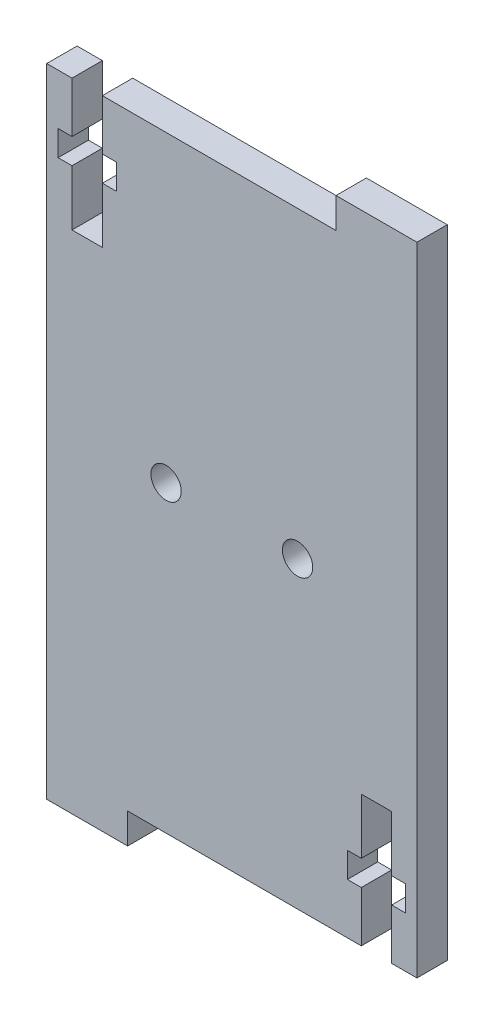
ISO-10303-21;
HEADER;
FILE_DESCRIPTION(('STEP AP214'),'2;1');
FILE_NAME('part.step','',(''),(''),'','','');
FILE_SCHEMA(('AUTOMOTIVE_DESIGN { 1 0 10303 214 1 1 1 1 }'));
ENDSEC;
DATA;
#1=APPLICATION_CONTEXT('core data for automotive mechanical design processes');
#2=APPLICATION_PROTOCOL_DEFINITION('international standard','automotive_design',2000,#1);
#3=PRODUCT_CONTEXT('',#1,'mechanical');
#4=PRODUCT('Part','Part','',(#3));
#5=PRODUCT_RELATED_PRODUCT_CATEGORY('part','',(#4));
#6=PRODUCT_DEFINITION_FORMATION('','',#4);
#7=PRODUCT_DEFINITION_CONTEXT('part definition',#1,'design');
#8=PRODUCT_DEFINITION('design','',#6,#7);
#9=PRODUCT_DEFINITION_SHAPE('','',#8);
#10=(LENGTH_UNIT() NAMED_UNIT(*) SI_UNIT(.MILLI.,.METRE.));
#11=(NAMED_UNIT(*) PLANE_ANGLE_UNIT() SI_UNIT($,.RADIAN.));
#12=(NAMED_UNIT(*) SI_UNIT($,.STERADIAN.) SOLID_ANGLE_UNIT());
#13=UNCERTAINTY_MEASURE_WITH_UNIT(LENGTH_MEASURE(1.E-05),#10,'distance_accuracy_value','');
#14=(GEOMETRIC_REPRESENTATION_CONTEXT(3) GLOBAL_UNCERTAINTY_ASSIGNED_CONTEXT((#13)) GLOBAL_UNIT_ASSIGNED_CONTEXT((#10,
#11,#12)) REPRESENTATION_CONTEXT('',''));
#15=CARTESIAN_POINT('',(0.,0.,0.));
#16=DIRECTION('',(0.,0.,1.));
#17=DIRECTION('',(1.,0.,0.));
#18=AXIS2_PLACEMENT_3D('',#15,#16,#17);
#19=CARTESIAN_POINT('',(0.,0.,3.));
#20=DIRECTION('',(0.,0.,-1.));
#21=DIRECTION('',(-1.,0.,0.));
#22=AXIS2_PLACEMENT_3D('',#19,#20,#21);
#23=PLANE('',#22);
#24=DIRECTION('',(1.,0.,0.));
#25=VECTOR('',#24,1.);
#26=CARTESIAN_POINT('',(24.8,-30.,3.));
#27=LINE('',#26,#25);
#28=CARTESIAN_POINT('',(22.3000000000002,-30.,3.));
#29=VERTEX_POINT('',#28);
#30=CARTESIAN_POINT('',(24.8,-30.,3.));
#31=VERTEX_POINT('',#30);
#32=EDGE_CURVE('E381',#29,#31,#27,.T.);
#33=ORIENTED_EDGE('',*,*,#32,.T.);
#34=DIRECTION('',(0.,1.,0.));
#35=VECTOR('',#34,1.);
#36=CARTESIAN_POINT('',(24.8,33.,3.));
#37=LINE('',#36,#35);
#38=CARTESIAN_POINT('',(24.8,33.,3.));
#39=VERTEX_POINT('',#38);
#40=EDGE_CURVE('E172',#31,#39,#37,.T.);
#41=ORIENTED_EDGE('',*,*,#40,.T.);
#42=DIRECTION('',(-1.,0.,0.));
#43=VECTOR('',#42,1.);
#44=CARTESIAN_POINT('',(24.8,33.,3.));
#45=LINE('',#44,#43);
#46=CARTESIAN_POINT('',(16.8,33.,3.));
#47=VERTEX_POINT('',#46);
#48=EDGE_CURVE('E498',#39,#47,#45,.T.);
#49=ORIENTED_EDGE('',*,*,#48,.T.);
#50=DIRECTION('',(0.,-1.,0.));
#51=VECTOR('',#50,1.);
#52=CARTESIAN_POINT('',(16.8,30.,3.));
#53=LINE('',#52,#51);
#54=CARTESIAN_POINT('',(16.8,30.,3.));
#55=VERTEX_POINT('',#54);
#56=EDGE_CURVE('E518',#47,#55,#53,.T.);
#57=ORIENTED_EDGE('',*,*,#56,.T.);
#58=DIRECTION('',(-1.,0.,0.));
#59=VECTOR('',#58,1.);
#60=CARTESIAN_POINT('',(16.8,30.,3.));
#61=LINE('',#60,#59);
#62=CARTESIAN_POINT('',(-6.29999999999978,30.,3.));
#63=VERTEX_POINT('',#62);
#64=EDGE_CURVE('E514',#55,#63,#61,.T.);
#65=ORIENTED_EDGE('',*,*,#64,.T.);
#66=DIRECTION('',(0.,-1.,0.));
#67=VECTOR('',#66,1.);
#68=CARTESIAN_POINT('',(-6.29999999999978,25.0000000000004,3.));
#69=LINE('',#68,#67);
#70=CARTESIAN_POINT('',(-6.29999999999978,25.0000000000004,3.));
#71=VERTEX_POINT('',#70);
#72=EDGE_CURVE('E517',#63,#71,#69,.T.);
#73=ORIENTED_EDGE('',*,*,#72,.T.);
#74=DIRECTION('',(1.,0.,0.));
#75=VECTOR('',#74,1.);
#76=CARTESIAN_POINT('',(-4.9249999999999,25.0000000000004,3.));
#77=LINE('',#76,#75);
#78=CARTESIAN_POINT('',(-4.9249999999999,25.0000000000004,3.));
#79=VERTEX_POINT('',#78);
#80=EDGE_CURVE('E522',#71,#79,#77,.T.);
#81=ORIENTED_EDGE('',*,*,#80,.T.);
#82=DIRECTION('',(0.,-1.,0.));
#83=VECTOR('',#82,1.);
#84=CARTESIAN_POINT('',(-4.9249999999999,22.5,3.));
#85=LINE('',#84,#83);
#86=CARTESIAN_POINT('',(-4.9249999999999,22.5,3.));
#87=VERTEX_POINT('',#86);
#88=EDGE_CURVE('E529',#79,#87,#85,.T.);
#89=ORIENTED_EDGE('',*,*,#88,.T.);
#90=DIRECTION('',(-1.,0.,0.));
#91=VECTOR('',#90,1.);
#92=CARTESIAN_POINT('',(-6.29999999999978,22.5,3.));
#93=LINE('',#92,#91);
#94=CARTESIAN_POINT('',(-6.29999999999978,22.5,3.));
#95=VERTEX_POINT('',#94);
#96=EDGE_CURVE('E532',#87,#95,#93,.T.);
#97=ORIENTED_EDGE('',*,*,#96,.T.);
#98=DIRECTION('',(0.,-1.,0.));
#99=VECTOR('',#98,1.);
#100=CARTESIAN_POINT('',(-6.29999999999978,17.,3.));
#101=LINE('',#100,#99);
#102=CARTESIAN_POINT('',(-6.29999999999978,17.,3.));
#103=VERTEX_POINT('',#102);
#104=EDGE_CURVE('E535',#95,#103,#101,.T.);
#105=ORIENTED_EDGE('',*,*,#104,.T.);
#106=DIRECTION('',(-1.,0.,0.));
#107=VECTOR('',#106,1.);
#108=CARTESIAN_POINT('',(-9.3000000000002,17.,3.));
#109=LINE('',#108,#107);
#110=CARTESIAN_POINT('',(-9.3000000000002,17.,3.));
#111=VERTEX_POINT('',#110);
#112=EDGE_CURVE('E538',#103,#111,#109,.T.);
#113=ORIENTED_EDGE('',*,*,#112,.T.);
#114=DIRECTION('',(0.,1.,0.));
#115=VECTOR('',#114,1.);
#116=CARTESIAN_POINT('',(-9.3000000000002,22.5,3.));
#117=LINE('',#116,#115);
#118=CARTESIAN_POINT('',(-9.3000000000002,22.5,3.));
#119=VERTEX_POINT('',#118);
#120=EDGE_CURVE('E541',#111,#119,#117,.T.);
#121=ORIENTED_EDGE('',*,*,#120,.T.);
#122=DIRECTION('',(-1.,0.,0.));
#123=VECTOR('',#122,1.);
#124=CARTESIAN_POINT('',(-10.6750000000008,22.5,3.));
#125=LINE('',#124,#123);
#126=CARTESIAN_POINT('',(-10.6750000000008,22.5,3.));
#127=VERTEX_POINT('',#126);
#128=EDGE_CURVE('E544',#119,#127,#125,.T.);
#129=ORIENTED_EDGE('',*,*,#128,.T.);
#130=DIRECTION('',(0.,1.,0.));
#131=VECTOR('',#130,1.);
#132=CARTESIAN_POINT('',(-10.6750000000008,25.0000000000004,3.));
#133=LINE('',#132,#131);
#134=CARTESIAN_POINT('',(-10.6750000000008,25.0000000000004,3.));
#135=VERTEX_POINT('',#134);
#136=EDGE_CURVE('E547',#127,#135,#133,.T.);
#137=ORIENTED_EDGE('',*,*,#136,.T.);
#138=DIRECTION('',(1.,0.,0.));
#139=VECTOR('',#138,1.);
#140=CARTESIAN_POINT('',(-9.3000000000002,25.0000000000004,3.));
#141=LINE('',#140,#139);
#142=CARTESIAN_POINT('',(-9.3000000000002,25.0000000000004,3.));
#143=VERTEX_POINT('',#142);
#144=EDGE_CURVE('E550',#135,#143,#141,.T.);
#145=ORIENTED_EDGE('',*,*,#144,.T.);
#146=DIRECTION('',(0.,1.,0.));
#147=VECTOR('',#146,1.);
#148=CARTESIAN_POINT('',(-9.3000000000002,30.,3.));
#149=LINE('',#148,#147);
#150=CARTESIAN_POINT('',(-9.3000000000002,30.,3.));
#151=VERTEX_POINT('',#150);
#152=EDGE_CURVE('E553',#143,#151,#149,.T.);
#153=ORIENTED_EDGE('',*,*,#152,.T.);
#154=DIRECTION('',(-1.,0.,0.));
#155=VECTOR('',#154,1.);
#156=CARTESIAN_POINT('',(-9.3000000000002,30.,3.));
#157=LINE('',#156,#155);
#158=CARTESIAN_POINT('',(-11.8,30.,3.));
#159=VERTEX_POINT('',#158);
#160=EDGE_CURVE('E556',#151,#159,#157,.T.);
#161=ORIENTED_EDGE('',*,*,#160,.T.);
#162=DIRECTION('',(0.,-1.,0.));
#163=VECTOR('',#162,1.);
#164=CARTESIAN_POINT('',(-11.8,30.,3.));
#165=LINE('',#164,#163);
#166=CARTESIAN_POINT('',(-11.8,-33.0000000000007,3.));
#167=VERTEX_POINT('',#166);
#168=EDGE_CURVE('E559',#159,#167,#165,.T.);
#169=ORIENTED_EDGE('',*,*,#168,.T.);
#170=DIRECTION('',(1.,0.,0.));
#171=VECTOR('',#170,1.);
#172=CARTESIAN_POINT('',(-3.8,-33.0000000000007,3.));
#173=LINE('',#172,#171);
#174=CARTESIAN_POINT('',(-3.8,-33.0000000000007,3.));
#175=VERTEX_POINT('',#174);
#176=EDGE_CURVE('E562',#167,#175,#173,.T.);
#177=ORIENTED_EDGE('',*,*,#176,.T.);
#178=DIRECTION('',(0.,1.,0.));
#179=VECTOR('',#178,1.);
#180=CARTESIAN_POINT('',(-3.8,-33.0000000000007,3.));
#181=LINE('',#180,#179);
#182=CARTESIAN_POINT('',(-3.8,-30.,3.));
#183=VERTEX_POINT('',#182);
#184=EDGE_CURVE('E565',#175,#183,#181,.T.);
#185=ORIENTED_EDGE('',*,*,#184,.T.);
#186=DIRECTION('',(1.,0.,0.));
#187=VECTOR('',#186,1.);
#188=CARTESIAN_POINT('',(19.2999999999998,-30.,3.));
#189=LINE('',#188,#187);
#190=CARTESIAN_POINT('',(19.2999999999998,-30.,3.));
#191=VERTEX_POINT('',#190);
#192=EDGE_CURVE('E568',#183,#191,#189,.T.);
#193=ORIENTED_EDGE('',*,*,#192,.T.);
#194=DIRECTION('',(0.,1.,0.));
#195=VECTOR('',#194,1.);
#196=CARTESIAN_POINT('',(19.2999999999998,-25.0000000000004,3.));
#197=LINE('',#196,#195);
#198=CARTESIAN_POINT('',(19.2999999999998,-25.0000000000004,3.));
#199=VERTEX_POINT('',#198);
#200=EDGE_CURVE('E571',#191,#199,#197,.T.);
#201=ORIENTED_EDGE('',*,*,#200,.T.);
#202=DIRECTION('',(-1.,0.,0.));
#203=VECTOR('',#202,1.);
#204=CARTESIAN_POINT('',(17.9249999999999,-25.0000000000004,3.));
#205=LINE('',#204,#203);
#206=CARTESIAN_POINT('',(17.9249999999999,-25.0000000000004,3.));
#207=VERTEX_POINT('',#206);
#208=EDGE_CURVE('E574',#199,#207,#205,.T.);
#209=ORIENTED_EDGE('',*,*,#208,.T.);
#210=DIRECTION('',(0.,1.,0.));
#211=VECTOR('',#210,1.);
#212=CARTESIAN_POINT('',(17.9249999999999,-22.5,3.));
#213=LINE('',#212,#211);
#214=CARTESIAN_POINT('',(17.9249999999999,-22.5,3.));
#215=VERTEX_POINT('',#214);
#216=EDGE_CURVE('E577',#207,#215,#213,.T.);
#217=ORIENTED_EDGE('',*,*,#216,.T.);
#218=DIRECTION('',(1.,0.,0.));
#219=VECTOR('',#218,1.);
#220=CARTESIAN_POINT('',(19.2999999999998,-22.5,3.));
#221=LINE('',#220,#219);
#222=CARTESIAN_POINT('',(19.2999999999998,-22.5,3.));
#223=VERTEX_POINT('',#222);
#224=EDGE_CURVE('E580',#215,#223,#221,.T.);
#225=ORIENTED_EDGE('',*,*,#224,.T.);
#226=DIRECTION('',(0.,1.,0.));
#227=VECTOR('',#226,1.);
#228=CARTESIAN_POINT('',(19.2999999999998,-17.,3.));
#229=LINE('',#228,#227);
#230=CARTESIAN_POINT('',(19.2999999999998,-17.,3.));
#231=VERTEX_POINT('',#230);
#232=EDGE_CURVE('E583',#223,#231,#229,.T.);
#233=ORIENTED_EDGE('',*,*,#232,.T.);
#234=DIRECTION('',(1.,0.,0.));
#235=VECTOR('',#234,1.);
#236=CARTESIAN_POINT('',(22.3000000000002,-17.,3.));
#237=LINE('',#236,#235);
#238=CARTESIAN_POINT('',(22.3000000000002,-17.,3.));
#239=VERTEX_POINT('',#238);
#240=EDGE_CURVE('E586',#231,#239,#237,.T.);
#241=ORIENTED_EDGE('',*,*,#240,.T.);
#242=DIRECTION('',(0.,-1.,0.));
#243=VECTOR('',#242,1.);
#244=CARTESIAN_POINT('',(22.3000000000002,-22.5,3.));
#245=LINE('',#244,#243);
#246=CARTESIAN_POINT('',(22.3000000000002,-22.5,3.));
#247=VERTEX_POINT('',#246);
#248=EDGE_CURVE('E589',#239,#247,#245,.T.);
#249=ORIENTED_EDGE('',*,*,#248,.T.);
#250=DIRECTION('',(1.,0.,0.));
#251=VECTOR('',#250,1.);
#252=CARTESIAN_POINT('',(23.6750000000008,-22.5,3.));
#253=LINE('',#252,#251);
#254=CARTESIAN_POINT('',(23.6750000000008,-22.5,3.));
#255=VERTEX_POINT('',#254);
#256=EDGE_CURVE('E263',#247,#255,#253,.T.);
#257=ORIENTED_EDGE('',*,*,#256,.T.);
#258=DIRECTION('',(0.,-1.,0.));
#259=VECTOR('',#258,1.);
#260=CARTESIAN_POINT('',(23.6750000000008,-25.0000000000004,3.));
#261=LINE('',#260,#259);
#262=CARTESIAN_POINT('',(23.6750000000008,-25.0000000000004,3.));
#263=VERTEX_POINT('',#262);
#264=EDGE_CURVE('E257',#255,#263,#261,.T.);
#265=ORIENTED_EDGE('',*,*,#264,.T.);
#266=DIRECTION('',(-1.,0.,0.));
#267=VECTOR('',#266,1.);
#268=CARTESIAN_POINT('',(22.3000000000002,-25.0000000000004,3.));
#269=LINE('',#268,#267);
#270=CARTESIAN_POINT('',(22.3000000000002,-25.0000000000004,3.));
#271=VERTEX_POINT('',#270);
#272=EDGE_CURVE('E261',#263,#271,#269,.T.);
#273=ORIENTED_EDGE('',*,*,#272,.T.);
#274=DIRECTION('',(0.,-1.,0.));
#275=VECTOR('',#274,1.);
#276=CARTESIAN_POINT('',(22.3000000000002,-30.,3.));
#277=LINE('',#276,#275);
#278=EDGE_CURVE('E57',#271,#29,#277,.T.);
#279=ORIENTED_EDGE('',*,*,#278,.T.);
#280=EDGE_LOOP('',(#33,#41,#49,#57,#65,#73,#81,#89,#97,#105,#113,#121,#129,#137,#145,#153,#161,
#169,#177,#185,#193,#201,#209,#217,#225,#233,#241,#249,#257,#265,#273,#279));
#281=FACE_BOUND('',#280,.T.);
#282=CARTESIAN_POINT('',(0.,0.,3.));
#283=DIRECTION('',(0.,0.,1.));
#284=DIRECTION('',(1.,0.,0.));
#285=AXIS2_PLACEMENT_3D('',#282,#283,#284);
#286=CIRCLE('',#285,1.50000000000001);
#287=CARTESIAN_POINT('',(1.50000000000001,0.,3.));
#288=VERTEX_POINT('',#287);
#289=EDGE_CURVE('E290',#288,#288,#286,.T.);
#290=ORIENTED_EDGE('',*,*,#289,.F.);
#291=EDGE_LOOP('',(#290));
#292=FACE_BOUND('',#291,.T.);
#293=CARTESIAN_POINT('',(13.,0.,3.));
#294=DIRECTION('',(0.,0.,1.));
#295=DIRECTION('',(1.,0.,0.));
#296=AXIS2_PLACEMENT_3D('',#293,#294,#295);
#297=CIRCLE('',#296,1.5);
#298=CARTESIAN_POINT('',(14.5,0.,3.));
#299=VERTEX_POINT('',#298);
#300=EDGE_CURVE('E632',#299,#299,#297,.T.);
#301=ORIENTED_EDGE('',*,*,#300,.F.);
#302=EDGE_LOOP('',(#301));
#303=FACE_BOUND('',#302,.T.);
#304=ADVANCED_FACE('F39',(#281,#292,#303),#23,.F.);
#305=CARTESIAN_POINT('',(0.,0.,0.));
#306=DIRECTION('',(0.,0.,-1.));
#307=DIRECTION('',(-1.,0.,0.));
#308=AXIS2_PLACEMENT_3D('',#305,#306,#307);
#309=PLANE('',#308);
#310=CARTESIAN_POINT('',(0.,0.,0.));
#311=DIRECTION('',(0.,0.,1.));
#312=DIRECTION('',(1.,0.,0.));
#313=AXIS2_PLACEMENT_3D('',#310,#311,#312);
#314=CIRCLE('',#313,1.50000000000001);
#315=CARTESIAN_POINT('',(1.50000000000001,0.,0.));
#316=VERTEX_POINT('',#315);
#317=EDGE_CURVE('E639',#316,#316,#314,.T.);
#318=ORIENTED_EDGE('',*,*,#317,.T.);
#319=EDGE_LOOP('',(#318));
#320=FACE_BOUND('',#319,.T.);
#321=DIRECTION('',(1.,0.,0.));
#322=VECTOR('',#321,1.);
#323=CARTESIAN_POINT('',(24.8,-30.,0.));
#324=LINE('',#323,#322);
#325=CARTESIAN_POINT('',(22.3000000000002,-30.,0.));
#326=VERTEX_POINT('',#325);
#327=CARTESIAN_POINT('',(24.8,-30.,0.));
#328=VERTEX_POINT('',#327);
#329=EDGE_CURVE('E285',#326,#328,#324,.T.);
#330=ORIENTED_EDGE('',*,*,#329,.F.);
#331=DIRECTION('',(0.,-1.,0.));
#332=VECTOR('',#331,1.);
#333=CARTESIAN_POINT('',(22.3000000000002,-30.,0.));
#334=LINE('',#333,#332);
#335=CARTESIAN_POINT('',(22.3000000000002,-25.0000000000004,0.));
#336=VERTEX_POINT('',#335);
#337=EDGE_CURVE('E164',#336,#326,#334,.T.);
#338=ORIENTED_EDGE('',*,*,#337,.F.);
#339=DIRECTION('',(-1.,0.,0.));
#340=VECTOR('',#339,1.);
#341=CARTESIAN_POINT('',(22.3000000000002,-25.0000000000004,0.));
#342=LINE('',#341,#340);
#343=CARTESIAN_POINT('',(23.6750000000008,-25.0000000000004,0.));
#344=VERTEX_POINT('',#343);
#345=EDGE_CURVE('E158',#344,#336,#342,.T.);
#346=ORIENTED_EDGE('',*,*,#345,.F.);
#347=DIRECTION('',(0.,-1.,0.));
#348=VECTOR('',#347,1.);
#349=CARTESIAN_POINT('',(23.6750000000008,-25.0000000000004,0.));
#350=LINE('',#349,#348);
#351=CARTESIAN_POINT('',(23.6750000000008,-22.5,0.));
#352=VERTEX_POINT('',#351);
#353=EDGE_CURVE('E272',#352,#344,#350,.T.);
#354=ORIENTED_EDGE('',*,*,#353,.F.);
#355=DIRECTION('',(1.,0.,0.));
#356=VECTOR('',#355,1.);
#357=CARTESIAN_POINT('',(23.6750000000008,-22.5,0.));
#358=LINE('',#357,#356);
#359=CARTESIAN_POINT('',(22.3000000000002,-22.5,0.));
#360=VERTEX_POINT('',#359);
#361=EDGE_CURVE('E372',#360,#352,#358,.T.);
#362=ORIENTED_EDGE('',*,*,#361,.F.);
#363=DIRECTION('',(0.,-1.,0.));
#364=VECTOR('',#363,1.);
#365=CARTESIAN_POINT('',(22.3000000000002,-22.5,0.));
#366=LINE('',#365,#364);
#367=CARTESIAN_POINT('',(22.3000000000002,-17.,0.));
#368=VERTEX_POINT('',#367);
#369=EDGE_CURVE('E369',#368,#360,#366,.T.);
#370=ORIENTED_EDGE('',*,*,#369,.F.);
#371=DIRECTION('',(1.,0.,0.));
#372=VECTOR('',#371,1.);
#373=CARTESIAN_POINT('',(22.3000000000002,-17.,0.));
#374=LINE('',#373,#372);
#375=CARTESIAN_POINT('',(19.2999999999998,-17.,0.));
#376=VERTEX_POINT('',#375);
#377=EDGE_CURVE('E366',#376,#368,#374,.T.);
#378=ORIENTED_EDGE('',*,*,#377,.F.);
#379=DIRECTION('',(0.,1.,0.));
#380=VECTOR('',#379,1.);
#381=CARTESIAN_POINT('',(19.2999999999998,-17.,0.));
#382=LINE('',#381,#380);
#383=CARTESIAN_POINT('',(19.2999999999998,-22.5,0.));
#384=VERTEX_POINT('',#383);
#385=EDGE_CURVE('E363',#384,#376,#382,.T.);
#386=ORIENTED_EDGE('',*,*,#385,.F.);
#387=DIRECTION('',(1.,0.,0.));
#388=VECTOR('',#387,1.);
#389=CARTESIAN_POINT('',(19.2999999999998,-22.5,0.));
#390=LINE('',#389,#388);
#391=CARTESIAN_POINT('',(17.9249999999999,-22.5,0.));
#392=VERTEX_POINT('',#391);
#393=EDGE_CURVE('E360',#392,#384,#390,.T.);
#394=ORIENTED_EDGE('',*,*,#393,.F.);
#395=DIRECTION('',(0.,1.,0.));
#396=VECTOR('',#395,1.);
#397=CARTESIAN_POINT('',(17.9249999999999,-22.5,0.));
#398=LINE('',#397,#396);
#399=CARTESIAN_POINT('',(17.9249999999999,-25.0000000000004,0.));
#400=VERTEX_POINT('',#399);
#401=EDGE_CURVE('E357',#400,#392,#398,.T.);
#402=ORIENTED_EDGE('',*,*,#401,.F.);
#403=DIRECTION('',(-1.,0.,0.));
#404=VECTOR('',#403,1.);
#405=CARTESIAN_POINT('',(17.9249999999999,-25.0000000000004,0.));
#406=LINE('',#405,#404);
#407=CARTESIAN_POINT('',(19.2999999999998,-25.0000000000004,0.));
#408=VERTEX_POINT('',#407);
#409=EDGE_CURVE('E354',#408,#400,#406,.T.);
#410=ORIENTED_EDGE('',*,*,#409,.F.);
#411=DIRECTION('',(0.,1.,0.));
#412=VECTOR('',#411,1.);
#413=CARTESIAN_POINT('',(19.2999999999998,-25.0000000000004,0.));
#414=LINE('',#413,#412);
#415=CARTESIAN_POINT('',(19.2999999999998,-30.,0.));
#416=VERTEX_POINT('',#415);
#417=EDGE_CURVE('E351',#416,#408,#414,.T.);
#418=ORIENTED_EDGE('',*,*,#417,.F.);
#419=DIRECTION('',(1.,0.,0.));
#420=VECTOR('',#419,1.);
#421=CARTESIAN_POINT('',(19.2999999999998,-30.,0.));
#422=LINE('',#421,#420);
#423=CARTESIAN_POINT('',(-3.8,-30.,0.));
#424=VERTEX_POINT('',#423);
#425=EDGE_CURVE('E348',#424,#416,#422,.T.);
#426=ORIENTED_EDGE('',*,*,#425,.F.);
#427=DIRECTION('',(0.,1.,0.));
#428=VECTOR('',#427,1.);
#429=CARTESIAN_POINT('',(-3.8,-33.0000000000007,0.));
#430=LINE('',#429,#428);
#431=CARTESIAN_POINT('',(-3.8,-33.0000000000007,0.));
#432=VERTEX_POINT('',#431);
#433=EDGE_CURVE('E345',#432,#424,#430,.T.);
#434=ORIENTED_EDGE('',*,*,#433,.F.);
#435=DIRECTION('',(1.,0.,0.));
#436=VECTOR('',#435,1.);
#437=CARTESIAN_POINT('',(-3.8,-33.0000000000007,0.));
#438=LINE('',#437,#436);
#439=CARTESIAN_POINT('',(-11.8,-33.0000000000007,0.));
#440=VERTEX_POINT('',#439);
#441=EDGE_CURVE('E342',#440,#432,#438,.T.);
#442=ORIENTED_EDGE('',*,*,#441,.F.);
#443=DIRECTION('',(0.,-1.,0.));
#444=VECTOR('',#443,1.);
#445=CARTESIAN_POINT('',(-11.8,-33.0000000000007,0.));
#446=LINE('',#445,#444);
#447=CARTESIAN_POINT('',(-11.8,30.,0.));
#448=VERTEX_POINT('',#447);
#449=EDGE_CURVE('E339',#448,#440,#446,.T.);
#450=ORIENTED_EDGE('',*,*,#449,.F.);
#451=DIRECTION('',(-1.,0.,0.));
#452=VECTOR('',#451,1.);
#453=CARTESIAN_POINT('',(-9.3000000000002,30.,0.));
#454=LINE('',#453,#452);
#455=CARTESIAN_POINT('',(-9.3000000000002,30.,0.));
#456=VERTEX_POINT('',#455);
#457=EDGE_CURVE('E335',#456,#448,#454,.T.);
#458=ORIENTED_EDGE('',*,*,#457,.F.);
#459=DIRECTION('',(0.,1.,0.));
#460=VECTOR('',#459,1.);
#461=CARTESIAN_POINT('',(-9.3000000000002,30.,0.));
#462=LINE('',#461,#460);
#463=CARTESIAN_POINT('',(-9.3000000000002,25.0000000000004,0.));
#464=VERTEX_POINT('',#463);
#465=EDGE_CURVE('E332',#464,#456,#462,.T.);
#466=ORIENTED_EDGE('',*,*,#465,.F.);
#467=DIRECTION('',(1.,0.,0.));
#468=VECTOR('',#467,1.);
#469=CARTESIAN_POINT('',(-9.3000000000002,25.0000000000004,0.));
#470=LINE('',#469,#468);
#471=CARTESIAN_POINT('',(-10.6750000000008,25.0000000000004,0.));
#472=VERTEX_POINT('',#471);
#473=EDGE_CURVE('E329',#472,#464,#470,.T.);
#474=ORIENTED_EDGE('',*,*,#473,.F.);
#475=DIRECTION('',(0.,1.,0.));
#476=VECTOR('',#475,1.);
#477=CARTESIAN_POINT('',(-10.6750000000008,25.0000000000004,0.));
#478=LINE('',#477,#476);
#479=CARTESIAN_POINT('',(-10.6750000000008,22.5,0.));
#480=VERTEX_POINT('',#479);
#481=EDGE_CURVE('E326',#480,#472,#478,.T.);
#482=ORIENTED_EDGE('',*,*,#481,.F.);
#483=DIRECTION('',(-1.,0.,0.));
#484=VECTOR('',#483,1.);
#485=CARTESIAN_POINT('',(-10.6750000000008,22.5,0.));
#486=LINE('',#485,#484);
#487=CARTESIAN_POINT('',(-9.3000000000002,22.5,0.));
#488=VERTEX_POINT('',#487);
#489=EDGE_CURVE('E323',#488,#480,#486,.T.);
#490=ORIENTED_EDGE('',*,*,#489,.F.);
#491=DIRECTION('',(0.,1.,0.));
#492=VECTOR('',#491,1.);
#493=CARTESIAN_POINT('',(-9.3000000000002,22.5,0.));
#494=LINE('',#493,#492);
#495=CARTESIAN_POINT('',(-9.3000000000002,17.,0.));
#496=VERTEX_POINT('',#495);
#497=EDGE_CURVE('E320',#496,#488,#494,.T.);
#498=ORIENTED_EDGE('',*,*,#497,.F.);
#499=DIRECTION('',(-1.,0.,0.));
#500=VECTOR('',#499,1.);
#501=CARTESIAN_POINT('',(-9.3000000000002,17.,0.));
#502=LINE('',#501,#500);
#503=CARTESIAN_POINT('',(-6.29999999999978,17.,0.));
#504=VERTEX_POINT('',#503);
#505=EDGE_CURVE('E317',#504,#496,#502,.T.);
#506=ORIENTED_EDGE('',*,*,#505,.F.);
#507=DIRECTION('',(0.,-1.,0.));
#508=VECTOR('',#507,1.);
#509=CARTESIAN_POINT('',(-6.29999999999978,17.,0.));
#510=LINE('',#509,#508);
#511=CARTESIAN_POINT('',(-6.29999999999978,22.5,0.));
#512=VERTEX_POINT('',#511);
#513=EDGE_CURVE('E314',#512,#504,#510,.T.);
#514=ORIENTED_EDGE('',*,*,#513,.F.);
#515=DIRECTION('',(-1.,0.,0.));
#516=VECTOR('',#515,1.);
#517=CARTESIAN_POINT('',(-6.29999999999978,22.5,0.));
#518=LINE('',#517,#516);
#519=CARTESIAN_POINT('',(-4.9249999999999,22.5,0.));
#520=VERTEX_POINT('',#519);
#521=EDGE_CURVE('E311',#520,#512,#518,.T.);
#522=ORIENTED_EDGE('',*,*,#521,.F.);
#523=DIRECTION('',(0.,-1.,0.));
#524=VECTOR('',#523,1.);
#525=CARTESIAN_POINT('',(-4.9249999999999,22.5,0.));
#526=LINE('',#525,#524);
#527=CARTESIAN_POINT('',(-4.9249999999999,25.0000000000004,0.));
#528=VERTEX_POINT('',#527);
#529=EDGE_CURVE('E308',#528,#520,#526,.T.);
#530=ORIENTED_EDGE('',*,*,#529,.F.);
#531=DIRECTION('',(1.,0.,0.));
#532=VECTOR('',#531,1.);
#533=CARTESIAN_POINT('',(-4.9249999999999,25.0000000000004,0.));
#534=LINE('',#533,#532);
#535=CARTESIAN_POINT('',(-6.29999999999978,25.0000000000004,0.));
#536=VERTEX_POINT('',#535);
#537=EDGE_CURVE('E305',#536,#528,#534,.T.);
#538=ORIENTED_EDGE('',*,*,#537,.F.);
#539=DIRECTION('',(0.,-1.,0.));
#540=VECTOR('',#539,1.);
#541=CARTESIAN_POINT('',(-6.29999999999978,25.0000000000004,0.));
#542=LINE('',#541,#540);
#543=CARTESIAN_POINT('',(-6.29999999999978,30.,0.));
#544=VERTEX_POINT('',#543);
#545=EDGE_CURVE('E302',#544,#536,#542,.T.);
#546=ORIENTED_EDGE('',*,*,#545,.F.);
#547=DIRECTION('',(-1.,0.,0.));
#548=VECTOR('',#547,1.);
#549=CARTESIAN_POINT('',(16.8,30.,0.));
#550=LINE('',#549,#548);
#551=CARTESIAN_POINT('',(16.8,30.,0.));
#552=VERTEX_POINT('',#551);
#553=EDGE_CURVE('E299',#552,#544,#550,.T.);
#554=ORIENTED_EDGE('',*,*,#553,.F.);
#555=DIRECTION('',(0.,-1.,0.));
#556=VECTOR('',#555,1.);
#557=CARTESIAN_POINT('',(16.8,30.,0.));
#558=LINE('',#557,#556);
#559=CARTESIAN_POINT('',(16.8,33.,0.));
#560=VERTEX_POINT('',#559);
#561=EDGE_CURVE('E296',#560,#552,#558,.T.);
#562=ORIENTED_EDGE('',*,*,#561,.F.);
#563=DIRECTION('',(-1.,0.,0.));
#564=VECTOR('',#563,1.);
#565=CARTESIAN_POINT('',(24.8,33.,0.));
#566=LINE('',#565,#564);
#567=CARTESIAN_POINT('',(24.8,33.,0.));
#568=VERTEX_POINT('',#567);
#569=EDGE_CURVE('E293',#568,#560,#566,.T.);
#570=ORIENTED_EDGE('',*,*,#569,.F.);
#571=DIRECTION('',(0.,1.,0.));
#572=VECTOR('',#571,1.);
#573=CARTESIAN_POINT('',(24.8,33.,0.));
#574=LINE('',#573,#572);
#575=EDGE_CURVE('E289',#328,#568,#574,.T.);
#576=ORIENTED_EDGE('',*,*,#575,.F.);
#577=EDGE_LOOP('',(#330,#338,#346,#354,#362,#370,#378,#386,#394,#402,#410,#418,#426,#434,#442,
#450,#458,#466,#474,#482,#490,#498,#506,#514,#522,#530,#538,#546,#554,#562,#570,#576));
#578=FACE_BOUND('',#577,.T.);
#579=CARTESIAN_POINT('',(13.,0.,0.));
#580=DIRECTION('',(0.,0.,1.));
#581=DIRECTION('',(1.,0.,0.));
#582=AXIS2_PLACEMENT_3D('',#579,#580,#581);
#583=CIRCLE('',#582,1.5);
#584=CARTESIAN_POINT('',(14.5,0.,0.));
#585=VERTEX_POINT('',#584);
#586=EDGE_CURVE('E635',#585,#585,#583,.T.);
#587=ORIENTED_EDGE('',*,*,#586,.T.);
#588=EDGE_LOOP('',(#587));
#589=FACE_BOUND('',#588,.T.);
#590=ADVANCED_FACE('F502',(#320,#578,#589),#309,.T.);
#591=CARTESIAN_POINT('',(24.8,-30.,3.));
#592=DIRECTION('',(0.,1.,0.));
#593=DIRECTION('',(0.,0.,1.));
#594=AXIS2_PLACEMENT_3D('',#591,#592,#593);
#595=PLANE('',#594);
#596=ORIENTED_EDGE('',*,*,#329,.T.);
#597=DIRECTION('',(0.,0.,-1.));
#598=VECTOR('',#597,1.);
#599=CARTESIAN_POINT('',(24.8,-30.,3.));
#600=LINE('',#599,#598);
#601=EDGE_CURVE('E11',#31,#328,#600,.T.);
#602=ORIENTED_EDGE('',*,*,#601,.F.);
#603=ORIENTED_EDGE('',*,*,#32,.F.);
#604=DIRECTION('',(0.,0.,-1.));
#605=VECTOR('',#604,1.);
#606=CARTESIAN_POINT('',(22.3000000000002,-30.,3.));
#607=LINE('',#606,#605);
#608=EDGE_CURVE('E281',#29,#326,#607,.T.);
#609=ORIENTED_EDGE('',*,*,#608,.T.);
#610=EDGE_LOOP('',(#596,#602,#603,#609));
#611=FACE_BOUND('',#610,.T.);
#612=ADVANCED_FACE('F41',(#611),#595,.F.);
#613=CARTESIAN_POINT('',(24.8,33.,3.));
#614=DIRECTION('',(-1.,0.,0.));
#615=DIRECTION('',(0.,0.,1.));
#616=AXIS2_PLACEMENT_3D('',#613,#614,#615);
#617=PLANE('',#616);
#618=ORIENTED_EDGE('',*,*,#575,.T.);
#619=DIRECTION('',(0.,0.,-1.));
#620=VECTOR('',#619,1.);
#621=CARTESIAN_POINT('',(24.8,33.,3.));
#622=LINE('',#621,#620);
#623=EDGE_CURVE('E49',#39,#568,#622,.T.);
#624=ORIENTED_EDGE('',*,*,#623,.F.);
#625=ORIENTED_EDGE('',*,*,#40,.F.);
#626=ORIENTED_EDGE('',*,*,#601,.T.);
#627=EDGE_LOOP('',(#618,#624,#625,#626));
#628=FACE_BOUND('',#627,.T.);
#629=ADVANCED_FACE('F941',(#628),#617,.F.);
#630=CARTESIAN_POINT('',(24.8,33.,3.));
#631=DIRECTION('',(0.,-1.,0.));
#632=DIRECTION('',(0.,0.,-1.));
#633=AXIS2_PLACEMENT_3D('',#630,#631,#632);
#634=PLANE('',#633);
#635=ORIENTED_EDGE('',*,*,#569,.T.);
#636=DIRECTION('',(0.,0.,-1.));
#637=VECTOR('',#636,1.);
#638=CARTESIAN_POINT('',(16.8,33.,3.));
#639=LINE('',#638,#637);
#640=EDGE_CURVE('E488',#47,#560,#639,.T.);
#641=ORIENTED_EDGE('',*,*,#640,.F.);
#642=ORIENTED_EDGE('',*,*,#48,.F.);
#643=ORIENTED_EDGE('',*,*,#623,.T.);
#644=EDGE_LOOP('',(#635,#641,#642,#643));
#645=FACE_BOUND('',#644,.T.);
#646=ADVANCED_FACE('F496',(#645),#634,.F.);
#647=CARTESIAN_POINT('',(16.8,30.,3.));
#648=DIRECTION('',(1.,0.,0.));
#649=DIRECTION('',(0.,0.,-1.));
#650=AXIS2_PLACEMENT_3D('',#647,#648,#649);
#651=PLANE('',#650);
#652=ORIENTED_EDGE('',*,*,#561,.T.);
#653=DIRECTION('',(0.,0.,-1.));
#654=VECTOR('',#653,1.);
#655=CARTESIAN_POINT('',(16.8,30.,3.));
#656=LINE('',#655,#654);
#657=EDGE_CURVE('E484',#55,#552,#656,.T.);
#658=ORIENTED_EDGE('',*,*,#657,.F.);
#659=ORIENTED_EDGE('',*,*,#56,.F.);
#660=ORIENTED_EDGE('',*,*,#640,.T.);
#661=EDGE_LOOP('',(#652,#658,#659,#660));
#662=FACE_BOUND('',#661,.T.);
#663=ADVANCED_FACE('F508',(#662),#651,.F.);
#664=CARTESIAN_POINT('',(16.8,30.,3.));
#665=DIRECTION('',(0.,-1.,0.));
#666=DIRECTION('',(1.,0.,0.));
#667=AXIS2_PLACEMENT_3D('',#664,#665,#666);
#668=PLANE('',#667);
#669=ORIENTED_EDGE('',*,*,#553,.T.);
#670=DIRECTION('',(0.,0.,-1.));
#671=VECTOR('',#670,1.);
#672=CARTESIAN_POINT('',(-6.29999999999978,30.,3.));
#673=LINE('',#672,#671);
#674=EDGE_CURVE('E480',#63,#544,#673,.T.);
#675=ORIENTED_EDGE('',*,*,#674,.F.);
#676=ORIENTED_EDGE('',*,*,#64,.F.);
#677=ORIENTED_EDGE('',*,*,#657,.T.);
#678=EDGE_LOOP('',(#669,#675,#676,#677));
#679=FACE_BOUND('',#678,.T.);
#680=ADVANCED_FACE('F512',(#679),#668,.F.);
#681=CARTESIAN_POINT('',(-6.29999999999978,25.0000000000004,3.));
#682=DIRECTION('',(1.,0.,0.));
#683=DIRECTION('',(0.,0.,-1.));
#684=AXIS2_PLACEMENT_3D('',#681,#682,#683);
#685=PLANE('',#684);
#686=ORIENTED_EDGE('',*,*,#545,.T.);
#687=DIRECTION('',(0.,0.,-1.));
#688=VECTOR('',#687,1.);
#689=CARTESIAN_POINT('',(-6.29999999999978,25.0000000000004,3.));
#690=LINE('',#689,#688);
#691=EDGE_CURVE('E476',#71,#536,#690,.T.);
#692=ORIENTED_EDGE('',*,*,#691,.F.);
#693=ORIENTED_EDGE('',*,*,#72,.F.);
#694=ORIENTED_EDGE('',*,*,#674,.T.);
#695=EDGE_LOOP('',(#686,#692,#693,#694));
#696=FACE_BOUND('',#695,.T.);
#697=ADVANCED_FACE('F906',(#696),#685,.F.);
#698=CARTESIAN_POINT('',(-4.9249999999999,25.0000000000004,3.));
#699=DIRECTION('',(0.,1.,0.));
#700=DIRECTION('',(0.,0.,1.));
#701=AXIS2_PLACEMENT_3D('',#698,#699,#700);
#702=PLANE('',#701);
#703=ORIENTED_EDGE('',*,*,#537,.T.);
#704=DIRECTION('',(0.,0.,-1.));
#705=VECTOR('',#704,1.);
#706=CARTESIAN_POINT('',(-4.9249999999999,25.0000000000004,3.));
#707=LINE('',#706,#705);
#708=EDGE_CURVE('E472',#79,#528,#707,.T.);
#709=ORIENTED_EDGE('',*,*,#708,.F.);
#710=ORIENTED_EDGE('',*,*,#80,.F.);
#711=ORIENTED_EDGE('',*,*,#691,.T.);
#712=EDGE_LOOP('',(#703,#709,#710,#711));
#713=FACE_BOUND('',#712,.T.);
#714=ADVANCED_FACE('F896',(#713),#702,.F.);
#715=CARTESIAN_POINT('',(-4.9249999999999,22.5,3.));
#716=DIRECTION('',(1.,0.,0.));
#717=DIRECTION('',(0.,0.,-1.));
#718=AXIS2_PLACEMENT_3D('',#715,#716,#717);
#719=PLANE('',#718);
#720=ORIENTED_EDGE('',*,*,#529,.T.);
#721=DIRECTION('',(0.,0.,-1.));
#722=VECTOR('',#721,1.);
#723=CARTESIAN_POINT('',(-4.9249999999999,22.5,3.));
#724=LINE('',#723,#722);
#725=EDGE_CURVE('E468',#87,#520,#724,.T.);
#726=ORIENTED_EDGE('',*,*,#725,.F.);
#727=ORIENTED_EDGE('',*,*,#88,.F.);
#728=ORIENTED_EDGE('',*,*,#708,.T.);
#729=EDGE_LOOP('',(#720,#726,#727,#728));
#730=FACE_BOUND('',#729,.T.);
#731=ADVANCED_FACE('F886',(#730),#719,.F.);
#732=CARTESIAN_POINT('',(-6.29999999999978,22.5,3.));
#733=DIRECTION('',(0.,-1.,0.));
#734=DIRECTION('',(0.,0.,-1.));
#735=AXIS2_PLACEMENT_3D('',#732,#733,#734);
#736=PLANE('',#735);
#737=ORIENTED_EDGE('',*,*,#521,.T.);
#738=DIRECTION('',(0.,0.,-1.));
#739=VECTOR('',#738,1.);
#740=CARTESIAN_POINT('',(-6.29999999999978,22.5,3.));
#741=LINE('',#740,#739);
#742=EDGE_CURVE('E464',#95,#512,#741,.T.);
#743=ORIENTED_EDGE('',*,*,#742,.F.);
#744=ORIENTED_EDGE('',*,*,#96,.F.);
#745=ORIENTED_EDGE('',*,*,#725,.T.);
#746=EDGE_LOOP('',(#737,#743,#744,#745));
#747=FACE_BOUND('',#746,.T.);
#748=ADVANCED_FACE('F876',(#747),#736,.F.);
#749=CARTESIAN_POINT('',(-6.29999999999978,17.,3.));
#750=DIRECTION('',(1.,0.,0.));
#751=DIRECTION('',(0.,0.,-1.));
#752=AXIS2_PLACEMENT_3D('',#749,#750,#751);
#753=PLANE('',#752);
#754=ORIENTED_EDGE('',*,*,#513,.T.);
#755=DIRECTION('',(0.,0.,-1.));
#756=VECTOR('',#755,1.);
#757=CARTESIAN_POINT('',(-6.29999999999978,17.,3.));
#758=LINE('',#757,#756);
#759=EDGE_CURVE('E460',#103,#504,#758,.T.);
#760=ORIENTED_EDGE('',*,*,#759,.F.);
#761=ORIENTED_EDGE('',*,*,#104,.F.);
#762=ORIENTED_EDGE('',*,*,#742,.T.);
#763=EDGE_LOOP('',(#754,#760,#761,#762));
#764=FACE_BOUND('',#763,.T.);
#765=ADVANCED_FACE('F866',(#764),#753,.F.);
#766=CARTESIAN_POINT('',(-9.3000000000002,17.,3.));
#767=DIRECTION('',(0.,-1.,0.));
#768=DIRECTION('',(0.,0.,-1.));
#769=AXIS2_PLACEMENT_3D('',#766,#767,#768);
#770=PLANE('',#769);
#771=ORIENTED_EDGE('',*,*,#505,.T.);
#772=DIRECTION('',(0.,0.,-1.));
#773=VECTOR('',#772,1.);
#774=CARTESIAN_POINT('',(-9.3000000000002,17.,3.));
#775=LINE('',#774,#773);
#776=EDGE_CURVE('E456',#111,#496,#775,.T.);
#777=ORIENTED_EDGE('',*,*,#776,.F.);
#778=ORIENTED_EDGE('',*,*,#112,.F.);
#779=ORIENTED_EDGE('',*,*,#759,.T.);
#780=EDGE_LOOP('',(#771,#777,#778,#779));
#781=FACE_BOUND('',#780,.T.);
#782=ADVANCED_FACE('F856',(#781),#770,.F.);
#783=CARTESIAN_POINT('',(-9.3000000000002,22.5,3.));
#784=DIRECTION('',(-1.,0.,0.));
#785=DIRECTION('',(0.,0.,1.));
#786=AXIS2_PLACEMENT_3D('',#783,#784,#785);
#787=PLANE('',#786);
#788=ORIENTED_EDGE('',*,*,#497,.T.);
#789=DIRECTION('',(0.,0.,-1.));
#790=VECTOR('',#789,1.);
#791=CARTESIAN_POINT('',(-9.3000000000002,22.5,3.));
#792=LINE('',#791,#790);
#793=EDGE_CURVE('E452',#119,#488,#792,.T.);
#794=ORIENTED_EDGE('',*,*,#793,.F.);
#795=ORIENTED_EDGE('',*,*,#120,.F.);
#796=ORIENTED_EDGE('',*,*,#776,.T.);
#797=EDGE_LOOP('',(#788,#794,#795,#796));
#798=FACE_BOUND('',#797,.T.);
#799=ADVANCED_FACE('F846',(#798),#787,.F.);
#800=CARTESIAN_POINT('',(-10.6750000000008,22.5,3.));
#801=DIRECTION('',(0.,-1.,0.));
#802=DIRECTION('',(0.,0.,-1.));
#803=AXIS2_PLACEMENT_3D('',#800,#801,#802);
#804=PLANE('',#803);
#805=ORIENTED_EDGE('',*,*,#489,.T.);
#806=DIRECTION('',(0.,0.,-1.));
#807=VECTOR('',#806,1.);
#808=CARTESIAN_POINT('',(-10.6750000000008,22.5,3.));
#809=LINE('',#808,#807);
#810=EDGE_CURVE('E448',#127,#480,#809,.T.);
#811=ORIENTED_EDGE('',*,*,#810,.F.);
#812=ORIENTED_EDGE('',*,*,#128,.F.);
#813=ORIENTED_EDGE('',*,*,#793,.T.);
#814=EDGE_LOOP('',(#805,#811,#812,#813));
#815=FACE_BOUND('',#814,.T.);
#816=ADVANCED_FACE('F836',(#815),#804,.F.);
#817=CARTESIAN_POINT('',(-10.6750000000008,25.0000000000004,3.));
#818=DIRECTION('',(-1.,0.,0.));
#819=DIRECTION('',(0.,0.,1.));
#820=AXIS2_PLACEMENT_3D('',#817,#818,#819);
#821=PLANE('',#820);
#822=ORIENTED_EDGE('',*,*,#481,.T.);
#823=DIRECTION('',(0.,0.,-1.));
#824=VECTOR('',#823,1.);
#825=CARTESIAN_POINT('',(-10.6750000000008,25.0000000000004,3.));
#826=LINE('',#825,#824);
#827=EDGE_CURVE('E444',#135,#472,#826,.T.);
#828=ORIENTED_EDGE('',*,*,#827,.F.);
#829=ORIENTED_EDGE('',*,*,#136,.F.);
#830=ORIENTED_EDGE('',*,*,#810,.T.);
#831=EDGE_LOOP('',(#822,#828,#829,#830));
#832=FACE_BOUND('',#831,.T.);
#833=ADVANCED_FACE('F826',(#832),#821,.F.);
#834=CARTESIAN_POINT('',(-9.3000000000002,25.0000000000004,3.));
#835=DIRECTION('',(0.,1.,0.));
#836=DIRECTION('',(0.,0.,1.));
#837=AXIS2_PLACEMENT_3D('',#834,#835,#836);
#838=PLANE('',#837);
#839=ORIENTED_EDGE('',*,*,#473,.T.);
#840=DIRECTION('',(0.,0.,-1.));
#841=VECTOR('',#840,1.);
#842=CARTESIAN_POINT('',(-9.3000000000002,25.0000000000004,3.));
#843=LINE('',#842,#841);
#844=EDGE_CURVE('E440',#143,#464,#843,.T.);
#845=ORIENTED_EDGE('',*,*,#844,.F.);
#846=ORIENTED_EDGE('',*,*,#144,.F.);
#847=ORIENTED_EDGE('',*,*,#827,.T.);
#848=EDGE_LOOP('',(#839,#845,#846,#847));
#849=FACE_BOUND('',#848,.T.);
#850=ADVANCED_FACE('F816',(#849),#838,.F.);
#851=CARTESIAN_POINT('',(-9.3000000000002,30.,3.));
#852=DIRECTION('',(-1.,0.,0.));
#853=DIRECTION('',(0.,0.,1.));
#854=AXIS2_PLACEMENT_3D('',#851,#852,#853);
#855=PLANE('',#854);
#856=ORIENTED_EDGE('',*,*,#465,.T.);
#857=DIRECTION('',(0.,0.,-1.));
#858=VECTOR('',#857,1.);
#859=CARTESIAN_POINT('',(-9.3000000000002,30.,3.));
#860=LINE('',#859,#858);
#861=EDGE_CURVE('E436',#151,#456,#860,.T.);
#862=ORIENTED_EDGE('',*,*,#861,.F.);
#863=ORIENTED_EDGE('',*,*,#152,.F.);
#864=ORIENTED_EDGE('',*,*,#844,.T.);
#865=EDGE_LOOP('',(#856,#862,#863,#864));
#866=FACE_BOUND('',#865,.T.);
#867=ADVANCED_FACE('F805',(#866),#855,.F.);
#868=CARTESIAN_POINT('',(-9.3000000000002,30.,3.));
#869=DIRECTION('',(0.,-1.,0.));
#870=DIRECTION('',(1.,0.,0.));
#871=AXIS2_PLACEMENT_3D('',#868,#869,#870);
#872=PLANE('',#871);
#873=ORIENTED_EDGE('',*,*,#457,.T.);
#874=DIRECTION('',(0.,0.,-1.));
#875=VECTOR('',#874,1.);
#876=CARTESIAN_POINT('',(-11.8,30.,3.));
#877=LINE('',#876,#875);
#878=EDGE_CURVE('E432',#159,#448,#877,.T.);
#879=ORIENTED_EDGE('',*,*,#878,.F.);
#880=ORIENTED_EDGE('',*,*,#160,.F.);
#881=ORIENTED_EDGE('',*,*,#861,.T.);
#882=EDGE_LOOP('',(#873,#879,#880,#881));
#883=FACE_BOUND('',#882,.T.);
#884=ADVANCED_FACE('F794',(#883),#872,.F.);
#885=CARTESIAN_POINT('',(-11.8,-33.0000000000007,3.));
#886=DIRECTION('',(1.,0.,0.));
#887=DIRECTION('',(0.,0.,-1.));
#888=AXIS2_PLACEMENT_3D('',#885,#886,#887);
#889=PLANE('',#888);
#890=ORIENTED_EDGE('',*,*,#449,.T.);
#891=DIRECTION('',(0.,0.,-1.));
#892=VECTOR('',#891,1.);
#893=CARTESIAN_POINT('',(-11.8,-33.0000000000007,3.));
#894=LINE('',#893,#892);
#895=EDGE_CURVE('E428',#167,#440,#894,.T.);
#896=ORIENTED_EDGE('',*,*,#895,.F.);
#897=ORIENTED_EDGE('',*,*,#168,.F.);
#898=ORIENTED_EDGE('',*,*,#878,.T.);
#899=EDGE_LOOP('',(#890,#896,#897,#898));
#900=FACE_BOUND('',#899,.T.);
#901=ADVANCED_FACE('F784',(#900),#889,.F.);
#902=CARTESIAN_POINT('',(-3.8,-33.0000000000007,3.));
#903=DIRECTION('',(0.,1.,0.));
#904=DIRECTION('',(0.,0.,1.));
#905=AXIS2_PLACEMENT_3D('',#902,#903,#904);
#906=PLANE('',#905);
#907=ORIENTED_EDGE('',*,*,#441,.T.);
#908=DIRECTION('',(0.,0.,-1.));
#909=VECTOR('',#908,1.);
#910=CARTESIAN_POINT('',(-3.8,-33.0000000000007,3.));
#911=LINE('',#910,#909);
#912=EDGE_CURVE('E424',#175,#432,#911,.T.);
#913=ORIENTED_EDGE('',*,*,#912,.F.);
#914=ORIENTED_EDGE('',*,*,#176,.F.);
#915=ORIENTED_EDGE('',*,*,#895,.T.);
#916=EDGE_LOOP('',(#907,#913,#914,#915));
#917=FACE_BOUND('',#916,.T.);
#918=ADVANCED_FACE('F774',(#917),#906,.F.);
#919=CARTESIAN_POINT('',(-3.8,-33.0000000000007,3.));
#920=DIRECTION('',(-1.,0.,0.));
#921=DIRECTION('',(0.,0.,1.));
#922=AXIS2_PLACEMENT_3D('',#919,#920,#921);
#923=PLANE('',#922);
#924=ORIENTED_EDGE('',*,*,#433,.T.);
#925=DIRECTION('',(0.,0.,-1.));
#926=VECTOR('',#925,1.);
#927=CARTESIAN_POINT('',(-3.8,-30.,3.));
#928=LINE('',#927,#926);
#929=EDGE_CURVE('E420',#183,#424,#928,.T.);
#930=ORIENTED_EDGE('',*,*,#929,.F.);
#931=ORIENTED_EDGE('',*,*,#184,.F.);
#932=ORIENTED_EDGE('',*,*,#912,.T.);
#933=EDGE_LOOP('',(#924,#930,#931,#932));
#934=FACE_BOUND('',#933,.T.);
#935=ADVANCED_FACE('F764',(#934),#923,.F.);
#936=CARTESIAN_POINT('',(19.2999999999998,-30.,3.));
#937=DIRECTION('',(0.,1.,0.));
#938=DIRECTION('',(-1.,0.,0.));
#939=AXIS2_PLACEMENT_3D('',#936,#937,#938);
#940=PLANE('',#939);
#941=ORIENTED_EDGE('',*,*,#425,.T.);
#942=DIRECTION('',(0.,0.,-1.));
#943=VECTOR('',#942,1.);
#944=CARTESIAN_POINT('',(19.2999999999998,-30.,3.));
#945=LINE('',#944,#943);
#946=EDGE_CURVE('E416',#191,#416,#945,.T.);
#947=ORIENTED_EDGE('',*,*,#946,.F.);
#948=ORIENTED_EDGE('',*,*,#192,.F.);
#949=ORIENTED_EDGE('',*,*,#929,.T.);
#950=EDGE_LOOP('',(#941,#947,#948,#949));
#951=FACE_BOUND('',#950,.T.);
#952=ADVANCED_FACE('F754',(#951),#940,.F.);
#953=CARTESIAN_POINT('',(19.2999999999998,-25.0000000000004,3.));
#954=DIRECTION('',(-1.,0.,0.));
#955=DIRECTION('',(0.,0.,1.));
#956=AXIS2_PLACEMENT_3D('',#953,#954,#955);
#957=PLANE('',#956);
#958=ORIENTED_EDGE('',*,*,#417,.T.);
#959=DIRECTION('',(0.,0.,-1.));
#960=VECTOR('',#959,1.);
#961=CARTESIAN_POINT('',(19.2999999999998,-25.0000000000004,3.));
#962=LINE('',#961,#960);
#963=EDGE_CURVE('E412',#199,#408,#962,.T.);
#964=ORIENTED_EDGE('',*,*,#963,.F.);
#965=ORIENTED_EDGE('',*,*,#200,.F.);
#966=ORIENTED_EDGE('',*,*,#946,.T.);
#967=EDGE_LOOP('',(#958,#964,#965,#966));
#968=FACE_BOUND('',#967,.T.);
#969=ADVANCED_FACE('F744',(#968),#957,.F.);
#970=CARTESIAN_POINT('',(17.9249999999999,-25.0000000000004,3.));
#971=DIRECTION('',(0.,-1.,0.));
#972=DIRECTION('',(0.,0.,-1.));
#973=AXIS2_PLACEMENT_3D('',#970,#971,#972);
#974=PLANE('',#973);
#975=ORIENTED_EDGE('',*,*,#409,.T.);
#976=DIRECTION('',(0.,0.,-1.));
#977=VECTOR('',#976,1.);
#978=CARTESIAN_POINT('',(17.9249999999999,-25.0000000000004,3.));
#979=LINE('',#978,#977);
#980=EDGE_CURVE('E408',#207,#400,#979,.T.);
#981=ORIENTED_EDGE('',*,*,#980,.F.);
#982=ORIENTED_EDGE('',*,*,#208,.F.);
#983=ORIENTED_EDGE('',*,*,#963,.T.);
#984=EDGE_LOOP('',(#975,#981,#982,#983));
#985=FACE_BOUND('',#984,.T.);
#986=ADVANCED_FACE('F734',(#985),#974,.F.);
#987=CARTESIAN_POINT('',(17.9249999999999,-22.5,3.));
#988=DIRECTION('',(-1.,0.,0.));
#989=DIRECTION('',(0.,0.,1.));
#990=AXIS2_PLACEMENT_3D('',#987,#988,#989);
#991=PLANE('',#990);
#992=ORIENTED_EDGE('',*,*,#401,.T.);
#993=DIRECTION('',(0.,0.,-1.));
#994=VECTOR('',#993,1.);
#995=CARTESIAN_POINT('',(17.9249999999999,-22.5,3.));
#996=LINE('',#995,#994);
#997=EDGE_CURVE('E404',#215,#392,#996,.T.);
#998=ORIENTED_EDGE('',*,*,#997,.F.);
#999=ORIENTED_EDGE('',*,*,#216,.F.);
#1000=ORIENTED_EDGE('',*,*,#980,.T.);
#1001=EDGE_LOOP('',(#992,#998,#999,#1000));
#1002=FACE_BOUND('',#1001,.T.);
#1003=ADVANCED_FACE('F724',(#1002),#991,.F.);
#1004=CARTESIAN_POINT('',(19.2999999999998,-22.5,3.));
#1005=DIRECTION('',(0.,1.,0.));
#1006=DIRECTION('',(0.,0.,1.));
#1007=AXIS2_PLACEMENT_3D('',#1004,#1005,#1006);
#1008=PLANE('',#1007);
#1009=ORIENTED_EDGE('',*,*,#393,.T.);
#1010=DIRECTION('',(0.,0.,-1.));
#1011=VECTOR('',#1010,1.);
#1012=CARTESIAN_POINT('',(19.2999999999998,-22.5,3.));
#1013=LINE('',#1012,#1011);
#1014=EDGE_CURVE('E400',#223,#384,#1013,.T.);
#1015=ORIENTED_EDGE('',*,*,#1014,.F.);
#1016=ORIENTED_EDGE('',*,*,#224,.F.);
#1017=ORIENTED_EDGE('',*,*,#997,.T.);
#1018=EDGE_LOOP('',(#1009,#1015,#1016,#1017));
#1019=FACE_BOUND('',#1018,.T.);
#1020=ADVANCED_FACE('F714',(#1019),#1008,.F.);
#1021=CARTESIAN_POINT('',(19.2999999999998,-17.,3.));
#1022=DIRECTION('',(-1.,0.,0.));
#1023=DIRECTION('',(0.,0.,1.));
#1024=AXIS2_PLACEMENT_3D('',#1021,#1022,#1023);
#1025=PLANE('',#1024);
#1026=ORIENTED_EDGE('',*,*,#385,.T.);
#1027=DIRECTION('',(0.,0.,-1.));
#1028=VECTOR('',#1027,1.);
#1029=CARTESIAN_POINT('',(19.2999999999998,-17.,3.));
#1030=LINE('',#1029,#1028);
#1031=EDGE_CURVE('E396',#231,#376,#1030,.T.);
#1032=ORIENTED_EDGE('',*,*,#1031,.F.);
#1033=ORIENTED_EDGE('',*,*,#232,.F.);
#1034=ORIENTED_EDGE('',*,*,#1014,.T.);
#1035=EDGE_LOOP('',(#1026,#1032,#1033,#1034));
#1036=FACE_BOUND('',#1035,.T.);
#1037=ADVANCED_FACE('F704',(#1036),#1025,.F.);
#1038=CARTESIAN_POINT('',(22.3000000000002,-17.,3.));
#1039=DIRECTION('',(0.,1.,0.));
#1040=DIRECTION('',(0.,0.,1.));
#1041=AXIS2_PLACEMENT_3D('',#1038,#1039,#1040);
#1042=PLANE('',#1041);
#1043=ORIENTED_EDGE('',*,*,#377,.T.);
#1044=DIRECTION('',(0.,0.,-1.));
#1045=VECTOR('',#1044,1.);
#1046=CARTESIAN_POINT('',(22.3000000000002,-17.,3.));
#1047=LINE('',#1046,#1045);
#1048=EDGE_CURVE('E392',#239,#368,#1047,.T.);
#1049=ORIENTED_EDGE('',*,*,#1048,.F.);
#1050=ORIENTED_EDGE('',*,*,#240,.F.);
#1051=ORIENTED_EDGE('',*,*,#1031,.T.);
#1052=EDGE_LOOP('',(#1043,#1049,#1050,#1051));
#1053=FACE_BOUND('',#1052,.T.);
#1054=ADVANCED_FACE('F695',(#1053),#1042,.F.);
#1055=CARTESIAN_POINT('',(22.3000000000002,-22.5,3.));
#1056=DIRECTION('',(1.,0.,0.));
#1057=DIRECTION('',(0.,0.,-1.));
#1058=AXIS2_PLACEMENT_3D('',#1055,#1056,#1057);
#1059=PLANE('',#1058);
#1060=ORIENTED_EDGE('',*,*,#369,.T.);
#1061=DIRECTION('',(0.,0.,-1.));
#1062=VECTOR('',#1061,1.);
#1063=CARTESIAN_POINT('',(22.3000000000002,-22.5,3.));
#1064=LINE('',#1063,#1062);
#1065=EDGE_CURVE('E388',#247,#360,#1064,.T.);
#1066=ORIENTED_EDGE('',*,*,#1065,.F.);
#1067=ORIENTED_EDGE('',*,*,#248,.F.);
#1068=ORIENTED_EDGE('',*,*,#1048,.T.);
#1069=EDGE_LOOP('',(#1060,#1066,#1067,#1068));
#1070=FACE_BOUND('',#1069,.T.);
#1071=ADVANCED_FACE('F597',(#1070),#1059,.F.);
#1072=CARTESIAN_POINT('',(23.6750000000008,-22.5,3.));
#1073=DIRECTION('',(0.,1.,0.));
#1074=DIRECTION('',(0.,0.,1.));
#1075=AXIS2_PLACEMENT_3D('',#1072,#1073,#1074);
#1076=PLANE('',#1075);
#1077=ORIENTED_EDGE('',*,*,#361,.T.);
#1078=DIRECTION('',(0.,0.,-1.));
#1079=VECTOR('',#1078,1.);
#1080=CARTESIAN_POINT('',(23.6750000000008,-22.5,3.));
#1081=LINE('',#1080,#1079);
#1082=EDGE_CURVE('E274',#255,#352,#1081,.T.);
#1083=ORIENTED_EDGE('',*,*,#1082,.F.);
#1084=ORIENTED_EDGE('',*,*,#256,.F.);
#1085=ORIENTED_EDGE('',*,*,#1065,.T.);
#1086=EDGE_LOOP('',(#1077,#1083,#1084,#1085));
#1087=FACE_BOUND('',#1086,.T.);
#1088=ADVANCED_FACE('F601',(#1087),#1076,.F.);
#1089=CARTESIAN_POINT('',(23.6750000000008,-25.0000000000004,3.));
#1090=DIRECTION('',(1.,0.,0.));
#1091=DIRECTION('',(0.,0.,-1.));
#1092=AXIS2_PLACEMENT_3D('',#1089,#1090,#1091);
#1093=PLANE('',#1092);
#1094=ORIENTED_EDGE('',*,*,#353,.T.);
#1095=DIRECTION('',(0.,0.,-1.));
#1096=VECTOR('',#1095,1.);
#1097=CARTESIAN_POINT('',(23.6750000000008,-25.0000000000004,3.));
#1098=LINE('',#1097,#1096);
#1099=EDGE_CURVE('E269',#263,#344,#1098,.T.);
#1100=ORIENTED_EDGE('',*,*,#1099,.F.);
#1101=ORIENTED_EDGE('',*,*,#264,.F.);
#1102=ORIENTED_EDGE('',*,*,#1082,.T.);
#1103=EDGE_LOOP('',(#1094,#1100,#1101,#1102));
#1104=FACE_BOUND('',#1103,.T.);
#1105=ADVANCED_FACE('F270',(#1104),#1093,.F.);
#1106=CARTESIAN_POINT('',(22.3000000000002,-25.0000000000004,3.));
#1107=DIRECTION('',(0.,-1.,0.));
#1108=DIRECTION('',(0.,0.,-1.));
#1109=AXIS2_PLACEMENT_3D('',#1106,#1107,#1108);
#1110=PLANE('',#1109);
#1111=ORIENTED_EDGE('',*,*,#345,.T.);
#1112=DIRECTION('',(0.,0.,-1.));
#1113=VECTOR('',#1112,1.);
#1114=CARTESIAN_POINT('',(22.3000000000002,-25.0000000000004,3.));
#1115=LINE('',#1114,#1113);
#1116=EDGE_CURVE('E275',#271,#336,#1115,.T.);
#1117=ORIENTED_EDGE('',*,*,#1116,.F.);
#1118=ORIENTED_EDGE('',*,*,#272,.F.);
#1119=ORIENTED_EDGE('',*,*,#1099,.T.);
#1120=EDGE_LOOP('',(#1111,#1117,#1118,#1119));
#1121=FACE_BOUND('',#1120,.T.);
#1122=ADVANCED_FACE('F277',(#1121),#1110,.F.);
#1123=CARTESIAN_POINT('',(22.3000000000002,-30.,3.));
#1124=DIRECTION('',(1.,0.,0.));
#1125=DIRECTION('',(0.,0.,-1.));
#1126=AXIS2_PLACEMENT_3D('',#1123,#1124,#1125);
#1127=PLANE('',#1126);
#1128=ORIENTED_EDGE('',*,*,#337,.T.);
#1129=ORIENTED_EDGE('',*,*,#608,.F.);
#1130=ORIENTED_EDGE('',*,*,#278,.F.);
#1131=ORIENTED_EDGE('',*,*,#1116,.T.);
#1132=EDGE_LOOP('',(#1128,#1129,#1130,#1131));
#1133=FACE_BOUND('',#1132,.T.);
#1134=ADVANCED_FACE('F605',(#1133),#1127,.F.);
#1135=CARTESIAN_POINT('',(0.,0.,3.));
#1136=DIRECTION('',(0.,0.,-1.));
#1137=DIRECTION('',(-1.,0.,0.));
#1138=AXIS2_PLACEMENT_3D('',#1135,#1136,#1137);
#1139=CYLINDRICAL_SURFACE('',#1138,1.50000000000001);
#1140=ORIENTED_EDGE('',*,*,#289,.T.);
#1141=EDGE_LOOP('',(#1140));
#1142=FACE_BOUND('',#1141,.T.);
#1143=ORIENTED_EDGE('',*,*,#317,.F.);
#1144=EDGE_LOOP('',(#1143));
#1145=FACE_BOUND('',#1144,.T.);
#1146=ADVANCED_FACE('F607',(#1142,#1145),#1139,.F.);
#1147=CARTESIAN_POINT('',(13.,0.,3.));
#1148=DIRECTION('',(0.,0.,-1.));
#1149=DIRECTION('',(-1.,0.,0.));
#1150=AXIS2_PLACEMENT_3D('',#1147,#1148,#1149);
#1151=CYLINDRICAL_SURFACE('',#1150,1.5);
#1152=ORIENTED_EDGE('',*,*,#300,.T.);
#1153=EDGE_LOOP('',(#1152));
#1154=FACE_BOUND('',#1153,.T.);
#1155=ORIENTED_EDGE('',*,*,#586,.F.);
#1156=EDGE_LOOP('',(#1155));
#1157=FACE_BOUND('',#1156,.T.);
#1158=ADVANCED_FACE('F613',(#1154,#1157),#1151,.F.);
#1159=CLOSED_SHELL('',(#304,#590,#612,#629,#646,#663,#680,#697,#714,#731,#748,#765,#782,#799,
#816,#833,#850,#867,#884,#901,#918,#935,#952,#969,#986,#1003,#1020,#1037,#1054,#1071,#1088,
#1105,#1122,#1134,#1146,#1158));
#1160=MANIFOLD_SOLID_BREP('B2',#1159);
#1161=ADVANCED_BREP_SHAPE_REPRESENTATION('',(#18,#1160),#14);
#1162=SHAPE_DEFINITION_REPRESENTATION(#9,#1161);
ENDSEC;
END-ISO-10303-21;
